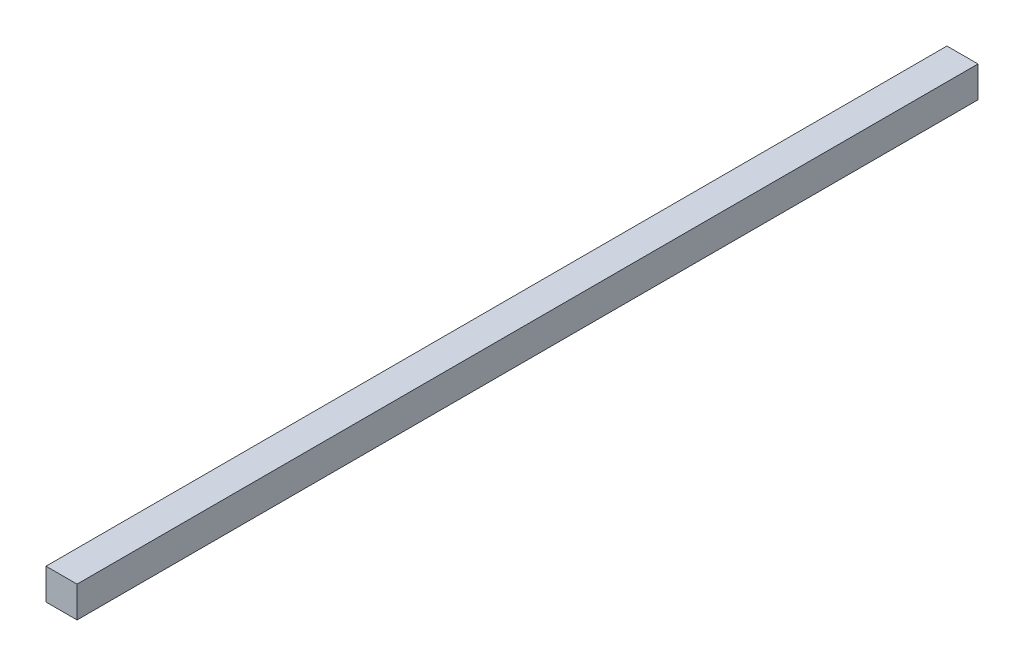
ISO-10303-21;
HEADER;
FILE_DESCRIPTION(('STEP AP214'),'2;1');
FILE_NAME('part.step','',(''),(''),'','','');
FILE_SCHEMA(('AUTOMOTIVE_DESIGN { 1 0 10303 214 1 1 1 1 }'));
ENDSEC;
DATA;
#1=APPLICATION_CONTEXT('core data for automotive mechanical design processes');
#2=APPLICATION_PROTOCOL_DEFINITION('international standard','automotive_design',2000,#1);
#3=PRODUCT_CONTEXT('',#1,'mechanical');
#4=PRODUCT('Part','Part','',(#3));
#5=PRODUCT_RELATED_PRODUCT_CATEGORY('part','',(#4));
#6=PRODUCT_DEFINITION_FORMATION('','',#4);
#7=PRODUCT_DEFINITION_CONTEXT('part definition',#1,'design');
#8=PRODUCT_DEFINITION('design','',#6,#7);
#9=PRODUCT_DEFINITION_SHAPE('','',#8);
#10=(LENGTH_UNIT() NAMED_UNIT(*) SI_UNIT(.MILLI.,.METRE.));
#11=(NAMED_UNIT(*) PLANE_ANGLE_UNIT() SI_UNIT($,.RADIAN.));
#12=(NAMED_UNIT(*) SI_UNIT($,.STERADIAN.) SOLID_ANGLE_UNIT());
#13=UNCERTAINTY_MEASURE_WITH_UNIT(LENGTH_MEASURE(1.E-05),#10,'distance_accuracy_value','');
#14=(GEOMETRIC_REPRESENTATION_CONTEXT(3) GLOBAL_UNCERTAINTY_ASSIGNED_CONTEXT((#13)) GLOBAL_UNIT_ASSIGNED_CONTEXT((#10,
#11,#12)) REPRESENTATION_CONTEXT('',''));
#15=CARTESIAN_POINT('',(0.,0.,0.));
#16=DIRECTION('',(0.,0.,1.));
#17=DIRECTION('',(1.,0.,0.));
#18=AXIS2_PLACEMENT_3D('',#15,#16,#17);
#19=CARTESIAN_POINT('',(0.254,-0.254,0.));
#20=DIRECTION('',(0.,-1.,0.));
#21=DIRECTION('',(0.,0.,-1.));
#22=AXIS2_PLACEMENT_3D('',#19,#20,#21);
#23=PLANE('',#22);
#24=DIRECTION('',(0.,0.,1.));
#25=VECTOR('',#24,1.);
#26=CARTESIAN_POINT('',(-0.254,-0.254,0.));
#27=LINE('',#26,#25);
#28=CARTESIAN_POINT('',(-0.254,-0.254,0.));
#29=VERTEX_POINT('',#28);
#30=CARTESIAN_POINT('',(-0.254,-0.254,14.732));
#31=VERTEX_POINT('',#30);
#32=EDGE_CURVE('E62',#29,#31,#27,.T.);
#33=ORIENTED_EDGE('',*,*,#32,.F.);
#34=DIRECTION('',(1.,0.,0.));
#35=VECTOR('',#34,1.);
#36=CARTESIAN_POINT('',(0.254,-0.254,0.));
#37=LINE('',#36,#35);
#38=CARTESIAN_POINT('',(0.254,-0.254,0.));
#39=VERTEX_POINT('',#38);
#40=EDGE_CURVE('E20',#29,#39,#37,.T.);
#41=ORIENTED_EDGE('',*,*,#40,.T.);
#42=DIRECTION('',(0.,0.,-1.));
#43=VECTOR('',#42,1.);
#44=CARTESIAN_POINT('',(0.254,-0.254,0.));
#45=LINE('',#44,#43);
#46=CARTESIAN_POINT('',(0.254,-0.254,14.732));
#47=VERTEX_POINT('',#46);
#48=EDGE_CURVE('E69',#47,#39,#45,.T.);
#49=ORIENTED_EDGE('',*,*,#48,.F.);
#50=DIRECTION('',(1.,0.,0.));
#51=VECTOR('',#50,1.);
#52=CARTESIAN_POINT('',(-0.254,-0.254,14.732));
#53=LINE('',#52,#51);
#54=EDGE_CURVE('E56',#31,#47,#53,.T.);
#55=ORIENTED_EDGE('',*,*,#54,.F.);
#56=EDGE_LOOP('',(#33,#41,#49,#55));
#57=FACE_BOUND('',#56,.T.);
#58=ADVANCED_FACE('F17',(#57),#23,.T.);
#59=CARTESIAN_POINT('',(-0.254,-0.254,0.));
#60=DIRECTION('',(-1.,0.,0.));
#61=DIRECTION('',(0.,0.,1.));
#62=AXIS2_PLACEMENT_3D('',#59,#60,#61);
#63=PLANE('',#62);
#64=DIRECTION('',(0.,0.,1.));
#65=VECTOR('',#64,1.);
#66=CARTESIAN_POINT('',(-0.254,0.254,0.));
#67=LINE('',#66,#65);
#68=CARTESIAN_POINT('',(-0.254,0.254,0.));
#69=VERTEX_POINT('',#68);
#70=CARTESIAN_POINT('',(-0.254,0.254,14.732));
#71=VERTEX_POINT('',#70);
#72=EDGE_CURVE('E83',#69,#71,#67,.T.);
#73=ORIENTED_EDGE('',*,*,#72,.F.);
#74=DIRECTION('',(0.,1.,0.));
#75=VECTOR('',#74,1.);
#76=CARTESIAN_POINT('',(-0.254,0.254,0.));
#77=LINE('',#76,#75);
#78=EDGE_CURVE('E67',#69,#29,#77,.F.);
#79=ORIENTED_EDGE('',*,*,#78,.T.);
#80=ORIENTED_EDGE('',*,*,#32,.T.);
#81=DIRECTION('',(0.,1.,0.));
#82=VECTOR('',#81,1.);
#83=CARTESIAN_POINT('',(-0.254,0.254,14.732));
#84=LINE('',#83,#82);
#85=EDGE_CURVE('E64',#71,#31,#84,.F.);
#86=ORIENTED_EDGE('',*,*,#85,.F.);
#87=EDGE_LOOP('',(#73,#79,#80,#86));
#88=FACE_BOUND('',#87,.T.);
#89=ADVANCED_FACE('F63',(#88),#63,.T.);
#90=CARTESIAN_POINT('',(-0.254,0.254,14.732));
#91=DIRECTION('',(0.,0.,1.));
#92=DIRECTION('',(1.,0.,0.));
#93=AXIS2_PLACEMENT_3D('',#90,#91,#92);
#94=PLANE('',#93);
#95=DIRECTION('',(0.,1.,0.));
#96=VECTOR('',#95,1.);
#97=CARTESIAN_POINT('',(0.254,0.254,14.732));
#98=LINE('',#97,#96);
#99=CARTESIAN_POINT('',(0.254,0.254,14.732));
#100=VERTEX_POINT('',#99);
#101=EDGE_CURVE('E71',#100,#47,#98,.F.);
#102=ORIENTED_EDGE('',*,*,#101,.F.);
#103=DIRECTION('',(1.,0.,0.));
#104=VECTOR('',#103,1.);
#105=CARTESIAN_POINT('',(-0.254,0.254,14.732));
#106=LINE('',#105,#104);
#107=EDGE_CURVE('E75',#71,#100,#106,.T.);
#108=ORIENTED_EDGE('',*,*,#107,.F.);
#109=ORIENTED_EDGE('',*,*,#85,.T.);
#110=ORIENTED_EDGE('',*,*,#54,.T.);
#111=EDGE_LOOP('',(#102,#108,#109,#110));
#112=FACE_BOUND('',#111,.T.);
#113=ADVANCED_FACE('F73',(#112),#94,.T.);
#114=CARTESIAN_POINT('',(0.254,0.254,0.));
#115=DIRECTION('',(1.,0.,0.));
#116=DIRECTION('',(0.,0.,-1.));
#117=AXIS2_PLACEMENT_3D('',#114,#115,#116);
#118=PLANE('',#117);
#119=ORIENTED_EDGE('',*,*,#48,.T.);
#120=DIRECTION('',(0.,1.,0.));
#121=VECTOR('',#120,1.);
#122=CARTESIAN_POINT('',(0.254,0.254,0.));
#123=LINE('',#122,#121);
#124=CARTESIAN_POINT('',(0.254,0.254,0.));
#125=VERTEX_POINT('',#124);
#126=EDGE_CURVE('E35',#39,#125,#123,.T.);
#127=ORIENTED_EDGE('',*,*,#126,.T.);
#128=DIRECTION('',(0.,0.,1.));
#129=VECTOR('',#128,1.);
#130=CARTESIAN_POINT('',(0.254,0.254,0.));
#131=LINE('',#130,#129);
#132=EDGE_CURVE('E26',#100,#125,#131,.F.);
#133=ORIENTED_EDGE('',*,*,#132,.F.);
#134=ORIENTED_EDGE('',*,*,#101,.T.);
#135=EDGE_LOOP('',(#119,#127,#133,#134));
#136=FACE_BOUND('',#135,.T.);
#137=ADVANCED_FACE('F89',(#136),#118,.T.);
#138=CARTESIAN_POINT('',(-0.254,0.254,0.));
#139=DIRECTION('',(0.,0.,1.));
#140=DIRECTION('',(1.,0.,0.));
#141=AXIS2_PLACEMENT_3D('',#138,#139,#140);
#142=PLANE('',#141);
#143=ORIENTED_EDGE('',*,*,#126,.F.);
#144=ORIENTED_EDGE('',*,*,#40,.F.);
#145=ORIENTED_EDGE('',*,*,#78,.F.);
#146=DIRECTION('',(1.,0.,0.));
#147=VECTOR('',#146,1.);
#148=CARTESIAN_POINT('',(-0.254,0.254,0.));
#149=LINE('',#148,#147);
#150=EDGE_CURVE('E11',#125,#69,#149,.F.);
#151=ORIENTED_EDGE('',*,*,#150,.F.);
#152=EDGE_LOOP('',(#143,#144,#145,#151));
#153=FACE_BOUND('',#152,.T.);
#154=ADVANCED_FACE('F91',(#153),#142,.F.);
#155=CARTESIAN_POINT('',(-0.254,0.254,0.));
#156=DIRECTION('',(0.,1.,0.));
#157=DIRECTION('',(0.,0.,1.));
#158=AXIS2_PLACEMENT_3D('',#155,#156,#157);
#159=PLANE('',#158);
#160=ORIENTED_EDGE('',*,*,#132,.T.);
#161=ORIENTED_EDGE('',*,*,#150,.T.);
#162=ORIENTED_EDGE('',*,*,#72,.T.);
#163=ORIENTED_EDGE('',*,*,#107,.T.);
#164=EDGE_LOOP('',(#160,#161,#162,#163));
#165=FACE_BOUND('',#164,.T.);
#166=ADVANCED_FACE('F88',(#165),#159,.T.);
#167=CLOSED_SHELL('',(#58,#89,#113,#137,#154,#166));
#168=MANIFOLD_SOLID_BREP('B1',#167);
#169=ADVANCED_BREP_SHAPE_REPRESENTATION('',(#18,#168),#14);
#170=SHAPE_DEFINITION_REPRESENTATION(#9,#169);
ENDSEC;
END-ISO-10303-21;
